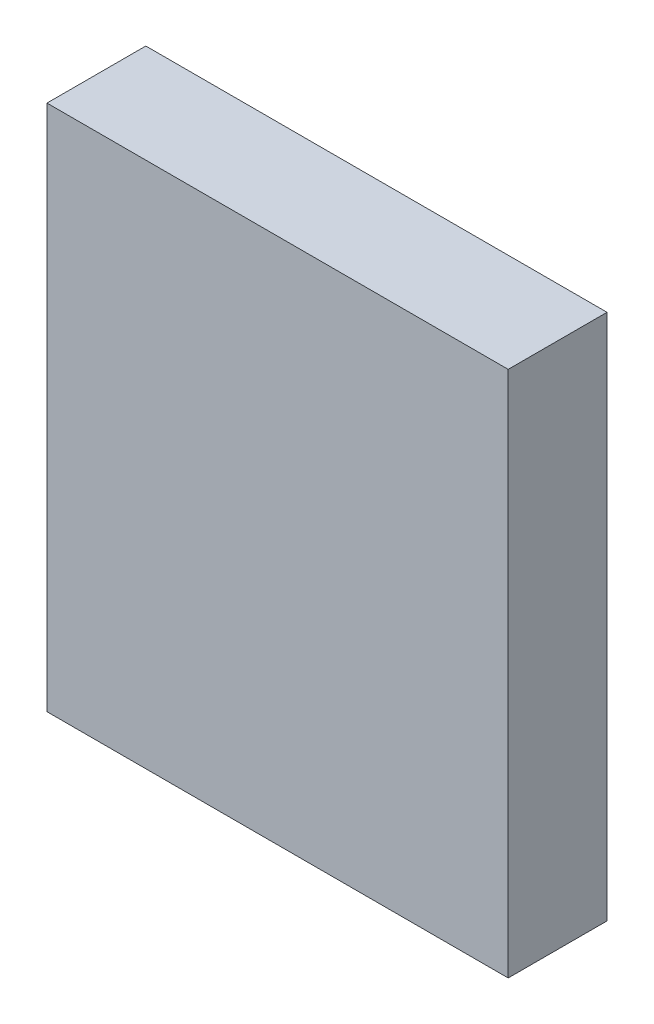
ISO-10303-21;
HEADER;
FILE_DESCRIPTION(('STEP AP214'),'2;1');
FILE_NAME('part.step','',(''),(''),'','','');
FILE_SCHEMA(('AUTOMOTIVE_DESIGN { 1 0 10303 214 1 1 1 1 }'));
ENDSEC;
DATA;
#1=APPLICATION_CONTEXT('core data for automotive mechanical design processes');
#2=APPLICATION_PROTOCOL_DEFINITION('international standard','automotive_design',2000,#1);
#3=PRODUCT_CONTEXT('',#1,'mechanical');
#4=PRODUCT('Part','Part','',(#3));
#5=PRODUCT_RELATED_PRODUCT_CATEGORY('part','',(#4));
#6=PRODUCT_DEFINITION_FORMATION('','',#4);
#7=PRODUCT_DEFINITION_CONTEXT('part definition',#1,'design');
#8=PRODUCT_DEFINITION('design','',#6,#7);
#9=PRODUCT_DEFINITION_SHAPE('','',#8);
#10=(LENGTH_UNIT() NAMED_UNIT(*) SI_UNIT(.MILLI.,.METRE.));
#11=(NAMED_UNIT(*) PLANE_ANGLE_UNIT() SI_UNIT($,.RADIAN.));
#12=(NAMED_UNIT(*) SI_UNIT($,.STERADIAN.) SOLID_ANGLE_UNIT());
#13=UNCERTAINTY_MEASURE_WITH_UNIT(LENGTH_MEASURE(1.E-05),#10,'distance_accuracy_value','');
#14=(GEOMETRIC_REPRESENTATION_CONTEXT(3) GLOBAL_UNCERTAINTY_ASSIGNED_CONTEXT((#13)) GLOBAL_UNIT_ASSIGNED_CONTEXT((#10,
#11,#12)) REPRESENTATION_CONTEXT('',''));
#15=CARTESIAN_POINT('',(0.,0.,0.));
#16=DIRECTION('',(0.,0.,1.));
#17=DIRECTION('',(1.,0.,0.));
#18=AXIS2_PLACEMENT_3D('',#15,#16,#17);
#19=CARTESIAN_POINT('',(0.,29.27740290761,76.2));
#20=DIRECTION('',(-1.,0.,0.));
#21=DIRECTION('',(0.,0.,1.));
#22=AXIS2_PLACEMENT_3D('',#19,#20,#21);
#23=PLANE('',#22);
#24=DIRECTION('',(0.,1.,0.));
#25=VECTOR('',#24,1.);
#26=CARTESIAN_POINT('',(0.,29.27740290761,0.));
#27=LINE('',#26,#25);
#28=CARTESIAN_POINT('',(0.,0.,0.));
#29=VERTEX_POINT('',#28);
#30=CARTESIAN_POINT('',(0.,406.4,0.));
#31=VERTEX_POINT('',#30);
#32=EDGE_CURVE('E101',#29,#31,#27,.T.);
#33=ORIENTED_EDGE('',*,*,#32,.F.);
#34=DIRECTION('',(0.,0.,-1.));
#35=VECTOR('',#34,1.);
#36=CARTESIAN_POINT('',(0.,0.,76.2));
#37=LINE('',#36,#35);
#38=CARTESIAN_POINT('',(0.,0.,76.2));
#39=VERTEX_POINT('',#38);
#40=EDGE_CURVE('E10',#39,#29,#37,.T.);
#41=ORIENTED_EDGE('',*,*,#40,.F.);
#42=DIRECTION('',(0.,1.,0.));
#43=VECTOR('',#42,1.);
#44=CARTESIAN_POINT('',(0.,29.27740290761,76.2));
#45=LINE('',#44,#43);
#46=CARTESIAN_POINT('',(0.,406.4,76.2));
#47=VERTEX_POINT('',#46);
#48=EDGE_CURVE('E79',#39,#47,#45,.T.);
#49=ORIENTED_EDGE('',*,*,#48,.T.);
#50=DIRECTION('',(0.,0.,-1.));
#51=VECTOR('',#50,1.);
#52=CARTESIAN_POINT('',(0.,406.4,76.2));
#53=LINE('',#52,#51);
#54=EDGE_CURVE('E38',#47,#31,#53,.T.);
#55=ORIENTED_EDGE('',*,*,#54,.T.);
#56=EDGE_LOOP('',(#33,#41,#49,#55));
#57=FACE_BOUND('',#56,.T.);
#58=ADVANCED_FACE('F16',(#57),#23,.T.);
#59=CARTESIAN_POINT('',(33.0767557024956,0.,76.2));
#60=DIRECTION('',(0.,1.,0.));
#61=DIRECTION('',(0.,0.,1.));
#62=AXIS2_PLACEMENT_3D('',#59,#60,#61);
#63=PLANE('',#62);
#64=DIRECTION('',(1.,0.,0.));
#65=VECTOR('',#64,1.);
#66=CARTESIAN_POINT('',(33.0767557024956,0.,0.));
#67=LINE('',#66,#65);
#68=CARTESIAN_POINT('',(355.6,0.,0.));
#69=VERTEX_POINT('',#68);
#70=EDGE_CURVE('E86',#29,#69,#67,.T.);
#71=ORIENTED_EDGE('',*,*,#70,.T.);
#72=DIRECTION('',(0.,0.,-1.));
#73=VECTOR('',#72,1.);
#74=CARTESIAN_POINT('',(355.6,0.,76.2));
#75=LINE('',#74,#73);
#76=CARTESIAN_POINT('',(355.6,0.,76.2));
#77=VERTEX_POINT('',#76);
#78=EDGE_CURVE('E25',#77,#69,#75,.T.);
#79=ORIENTED_EDGE('',*,*,#78,.F.);
#80=DIRECTION('',(1.,0.,0.));
#81=VECTOR('',#80,1.);
#82=CARTESIAN_POINT('',(33.0767557024956,0.,76.2));
#83=LINE('',#82,#81);
#84=EDGE_CURVE('E73',#39,#77,#83,.T.);
#85=ORIENTED_EDGE('',*,*,#84,.F.);
#86=ORIENTED_EDGE('',*,*,#40,.T.);
#87=EDGE_LOOP('',(#71,#79,#85,#86));
#88=FACE_BOUND('',#87,.T.);
#89=ADVANCED_FACE('F84',(#88),#63,.F.);
#90=CARTESIAN_POINT('',(355.6,29.27740290761,76.2));
#91=DIRECTION('',(-1.,0.,0.));
#92=DIRECTION('',(0.,-1.,0.));
#93=AXIS2_PLACEMENT_3D('',#90,#91,#92);
#94=PLANE('',#93);
#95=DIRECTION('',(0.,1.,0.));
#96=VECTOR('',#95,1.);
#97=CARTESIAN_POINT('',(355.6,29.27740290761,0.));
#98=LINE('',#97,#96);
#99=CARTESIAN_POINT('',(355.6,406.4,0.));
#100=VERTEX_POINT('',#99);
#101=EDGE_CURVE('E106',#69,#100,#98,.T.);
#102=ORIENTED_EDGE('',*,*,#101,.T.);
#103=DIRECTION('',(0.,0.,-1.));
#104=VECTOR('',#103,1.);
#105=CARTESIAN_POINT('',(355.6,406.4,76.2));
#106=LINE('',#105,#104);
#107=CARTESIAN_POINT('',(355.6,406.4,76.2));
#108=VERTEX_POINT('',#107);
#109=EDGE_CURVE('E56',#108,#100,#106,.T.);
#110=ORIENTED_EDGE('',*,*,#109,.F.);
#111=DIRECTION('',(0.,1.,0.));
#112=VECTOR('',#111,1.);
#113=CARTESIAN_POINT('',(355.6,29.27740290761,76.2));
#114=LINE('',#113,#112);
#115=EDGE_CURVE('E78',#77,#108,#114,.T.);
#116=ORIENTED_EDGE('',*,*,#115,.F.);
#117=ORIENTED_EDGE('',*,*,#78,.T.);
#118=EDGE_LOOP('',(#102,#110,#116,#117));
#119=FACE_BOUND('',#118,.T.);
#120=ADVANCED_FACE('F90',(#119),#94,.F.);
#121=CARTESIAN_POINT('',(33.0767557024955,406.4,76.2));
#122=DIRECTION('',(0.,1.,0.));
#123=DIRECTION('',(0.,0.,1.));
#124=AXIS2_PLACEMENT_3D('',#121,#122,#123);
#125=PLANE('',#124);
#126=DIRECTION('',(1.,0.,0.));
#127=VECTOR('',#126,1.);
#128=CARTESIAN_POINT('',(33.0767557024955,406.4,0.));
#129=LINE('',#128,#127);
#130=EDGE_CURVE('E108',#31,#100,#129,.T.);
#131=ORIENTED_EDGE('',*,*,#130,.F.);
#132=ORIENTED_EDGE('',*,*,#54,.F.);
#133=DIRECTION('',(1.,0.,0.));
#134=VECTOR('',#133,1.);
#135=CARTESIAN_POINT('',(33.0767557024955,406.4,76.2));
#136=LINE('',#135,#134);
#137=EDGE_CURVE('E92',#47,#108,#136,.T.);
#138=ORIENTED_EDGE('',*,*,#137,.T.);
#139=ORIENTED_EDGE('',*,*,#109,.T.);
#140=EDGE_LOOP('',(#131,#132,#138,#139));
#141=FACE_BOUND('',#140,.T.);
#142=ADVANCED_FACE('F127',(#141),#125,.T.);
#143=CARTESIAN_POINT('',(177.8,203.2,76.2));
#144=DIRECTION('',(0.,0.,1.));
#145=DIRECTION('',(1.,0.,0.));
#146=AXIS2_PLACEMENT_3D('',#143,#144,#145);
#147=PLANE('',#146);
#148=ORIENTED_EDGE('',*,*,#48,.F.);
#149=ORIENTED_EDGE('',*,*,#84,.T.);
#150=ORIENTED_EDGE('',*,*,#115,.T.);
#151=ORIENTED_EDGE('',*,*,#137,.F.);
#152=EDGE_LOOP('',(#148,#149,#150,#151));
#153=FACE_BOUND('',#152,.T.);
#154=ADVANCED_FACE('F75',(#153),#147,.T.);
#155=CARTESIAN_POINT('',(177.8,203.2,0.));
#156=DIRECTION('',(0.,0.,1.));
#157=DIRECTION('',(1.,0.,0.));
#158=AXIS2_PLACEMENT_3D('',#155,#156,#157);
#159=PLANE('',#158);
#160=ORIENTED_EDGE('',*,*,#32,.T.);
#161=ORIENTED_EDGE('',*,*,#130,.T.);
#162=ORIENTED_EDGE('',*,*,#101,.F.);
#163=ORIENTED_EDGE('',*,*,#70,.F.);
#164=EDGE_LOOP('',(#160,#161,#162,#163));
#165=FACE_BOUND('',#164,.T.);
#166=ADVANCED_FACE('F133',(#165),#159,.F.);
#167=CLOSED_SHELL('',(#58,#89,#120,#142,#154,#166));
#168=MANIFOLD_SOLID_BREP('B1',#167);
#169=ADVANCED_BREP_SHAPE_REPRESENTATION('',(#18,#168),#14);
#170=SHAPE_DEFINITION_REPRESENTATION(#9,#169);
ENDSEC;
END-ISO-10303-21;
